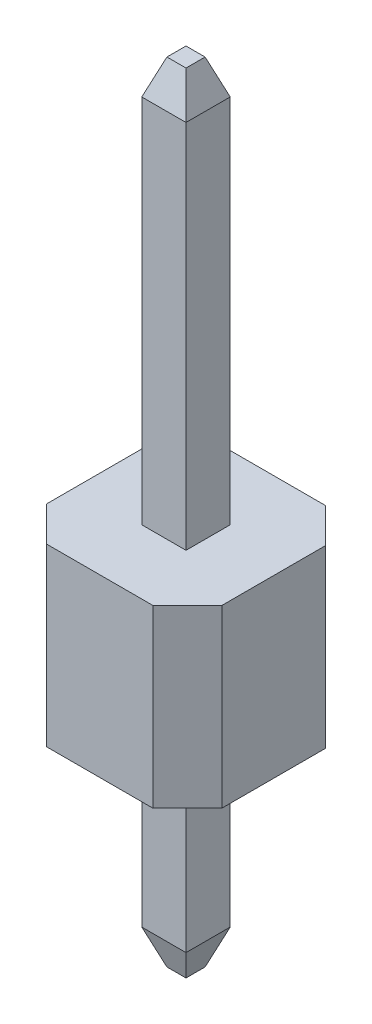
ISO-10303-21;
HEADER;
FILE_DESCRIPTION(('STEP AP214'),'2;1');
FILE_NAME('part.step','',(''),(''),'','','');
FILE_SCHEMA(('AUTOMOTIVE_DESIGN { 1 0 10303 214 1 1 1 1 }'));
ENDSEC;
DATA;
#1=APPLICATION_CONTEXT('core data for automotive mechanical design processes');
#2=APPLICATION_PROTOCOL_DEFINITION('international standard','automotive_design',2000,#1);
#3=PRODUCT_CONTEXT('',#1,'mechanical');
#4=PRODUCT('Part','Part','',(#3));
#5=PRODUCT_RELATED_PRODUCT_CATEGORY('part','',(#4));
#6=PRODUCT_DEFINITION_FORMATION('','',#4);
#7=PRODUCT_DEFINITION_CONTEXT('part definition',#1,'design');
#8=PRODUCT_DEFINITION('design','',#6,#7);
#9=PRODUCT_DEFINITION_SHAPE('','',#8);
#10=(LENGTH_UNIT() NAMED_UNIT(*) SI_UNIT(.MILLI.,.METRE.));
#11=(NAMED_UNIT(*) PLANE_ANGLE_UNIT() SI_UNIT($,.RADIAN.));
#12=(NAMED_UNIT(*) SI_UNIT($,.STERADIAN.) SOLID_ANGLE_UNIT());
#13=UNCERTAINTY_MEASURE_WITH_UNIT(LENGTH_MEASURE(1.E-05),#10,'distance_accuracy_value','');
#14=(GEOMETRIC_REPRESENTATION_CONTEXT(3) GLOBAL_UNCERTAINTY_ASSIGNED_CONTEXT((#13)) GLOBAL_UNIT_ASSIGNED_CONTEXT((#10,
#11,#12)) REPRESENTATION_CONTEXT('',''));
#15=CARTESIAN_POINT('',(0.,0.,0.));
#16=DIRECTION('',(0.,0.,1.));
#17=DIRECTION('',(1.,0.,0.));
#18=AXIS2_PLACEMENT_3D('',#15,#16,#17);
#19=CARTESIAN_POINT('',(-20.5046575219933,-116.166087876259,67.0858140827478));
#20=DIRECTION('',(0.,0.342020143325667,-0.939692620785909));
#21=DIRECTION('',(-1.,0.,0.));
#22=AXIS2_PLACEMENT_3D('',#19,#20,#21);
#23=PLANE('',#22);
#24=DIRECTION('',(0.323615577118189,0.889126490715985,0.323615577118189));
#25=VECTOR('',#24,1.);
#26=CARTESIAN_POINT('',(-20.381096529517,-116.205799613767,67.0713601923572));
#27=LINE('',#26,#25);
#28=CARTESIAN_POINT('',(-20.3666426391264,-116.166087876259,67.0858140827478));
#29=VERTEX_POINT('',#28);
#30=CARTESIAN_POINT('',(-20.1846575219933,-115.666087876259,67.2677991998809));
#31=VERTEX_POINT('',#30);
#32=EDGE_CURVE('E41',#29,#31,#27,.T.);
#33=ORIENTED_EDGE('',*,*,#32,.T.);
#34=DIRECTION('',(1.,0.,0.));
#35=VECTOR('',#34,1.);
#36=CARTESIAN_POINT('',(-20.1846575219833,-115.666087876269,67.2677991998909));
#37=LINE('',#36,#35);
#38=CARTESIAN_POINT('',(-20.8246575219933,-115.666087876259,67.2677991998809));
#39=VERTEX_POINT('',#38);
#40=EDGE_CURVE('E11',#39,#31,#37,.T.);
#41=ORIENTED_EDGE('',*,*,#40,.F.);
#42=DIRECTION('',(0.323615577118189,-0.889126490715985,-0.323615577118189));
#43=VECTOR('',#42,1.);
#44=CARTESIAN_POINT('',(-20.6282185144696,-116.205799613767,67.0713601923572));
#45=LINE('',#44,#43);
#46=CARTESIAN_POINT('',(-20.6426724048602,-116.166087876259,67.0858140827478));
#47=VERTEX_POINT('',#46);
#48=EDGE_CURVE('E241',#39,#47,#45,.T.);
#49=ORIENTED_EDGE('',*,*,#48,.T.);
#50=DIRECTION('',(-1.,0.,0.));
#51=VECTOR('',#50,1.);
#52=CARTESIAN_POINT('',(-20.5046575219933,-116.166087876269,67.0858140827578));
#53=LINE('',#52,#51);
#54=EDGE_CURVE('E246',#29,#47,#53,.T.);
#55=ORIENTED_EDGE('',*,*,#54,.F.);
#56=EDGE_LOOP('',(#33,#41,#49,#55));
#57=FACE_BOUND('',#56,.T.);
#58=ADVANCED_FACE('F17',(#57),#23,.F.);
#59=CARTESIAN_POINT('',(-20.1846575219933,-104.766087876259,67.2677991998809));
#60=DIRECTION('',(0.,0.,-1.));
#61=DIRECTION('',(0.,-1.,0.));
#62=AXIS2_PLACEMENT_3D('',#59,#60,#61);
#63=PLANE('',#62);
#64=DIRECTION('',(1.,0.,0.));
#65=VECTOR('',#64,1.);
#66=CARTESIAN_POINT('',(-20.1846575219833,-113.166087876259,67.2677991998909));
#67=LINE('',#66,#65);
#68=CARTESIAN_POINT('',(-20.8246575219933,-113.166087876259,67.2677991998809));
#69=VERTEX_POINT('',#68);
#70=CARTESIAN_POINT('',(-20.1846575219933,-113.166087876259,67.2677991998809));
#71=VERTEX_POINT('',#70);
#72=EDGE_CURVE('E271',#69,#71,#67,.T.);
#73=ORIENTED_EDGE('',*,*,#72,.F.);
#74=DIRECTION('',(0.,-1.,0.));
#75=VECTOR('',#74,1.);
#76=CARTESIAN_POINT('',(-20.8246575220033,-104.766087876249,67.2677991998909));
#77=LINE('',#76,#75);
#78=EDGE_CURVE('E198',#69,#39,#77,.T.);
#79=ORIENTED_EDGE('',*,*,#78,.T.);
#80=ORIENTED_EDGE('',*,*,#40,.T.);
#81=DIRECTION('',(0.,-1.,0.));
#82=VECTOR('',#81,1.);
#83=CARTESIAN_POINT('',(-20.1846575219833,-104.766087876249,67.2677991998909));
#84=LINE('',#83,#82);
#85=EDGE_CURVE('E289',#71,#31,#84,.T.);
#86=ORIENTED_EDGE('',*,*,#85,.F.);
#87=EDGE_LOOP('',(#73,#79,#80,#86));
#88=FACE_BOUND('',#87,.T.);
#89=ADVANCED_FACE('F459',(#88),#63,.F.);
#90=CARTESIAN_POINT('',(-20.1846575219933,-104.766087876259,67.2677991998809));
#91=DIRECTION('',(0.,0.,-1.));
#92=DIRECTION('',(0.,-1.,0.));
#93=AXIS2_PLACEMENT_3D('',#90,#91,#92);
#94=PLANE('',#93);
#95=DIRECTION('',(0.,-1.,0.));
#96=VECTOR('',#95,1.);
#97=CARTESIAN_POINT('',(-20.8246575220033,-104.766087876249,67.2677991998909));
#98=LINE('',#97,#96);
#99=CARTESIAN_POINT('',(-20.8246575219933,-105.266087876259,67.2677991998809));
#100=VERTEX_POINT('',#99);
#101=CARTESIAN_POINT('',(-20.8246575219933,-110.626087876259,67.2677991998809));
#102=VERTEX_POINT('',#101);
#103=EDGE_CURVE('E27',#100,#102,#98,.T.);
#104=ORIENTED_EDGE('',*,*,#103,.T.);
#105=DIRECTION('',(1.,0.,0.));
#106=VECTOR('',#105,1.);
#107=CARTESIAN_POINT('',(-20.1846575219833,-110.626087876249,67.2677991998909));
#108=LINE('',#107,#106);
#109=CARTESIAN_POINT('',(-20.1846575219933,-110.626087876259,67.2677991998809));
#110=VERTEX_POINT('',#109);
#111=EDGE_CURVE('E230',#102,#110,#108,.T.);
#112=ORIENTED_EDGE('',*,*,#111,.T.);
#113=DIRECTION('',(0.,-1.,0.));
#114=VECTOR('',#113,1.);
#115=CARTESIAN_POINT('',(-20.1846575219833,-104.766087876249,67.2677991998909));
#116=LINE('',#115,#114);
#117=CARTESIAN_POINT('',(-20.1846575219933,-105.266087876259,67.2677991998809));
#118=VERTEX_POINT('',#117);
#119=EDGE_CURVE('E302',#118,#110,#116,.T.);
#120=ORIENTED_EDGE('',*,*,#119,.F.);
#121=DIRECTION('',(-1.,0.,0.));
#122=VECTOR('',#121,1.);
#123=CARTESIAN_POINT('',(-20.8246575220033,-105.266087876249,67.2677991998909));
#124=LINE('',#123,#122);
#125=EDGE_CURVE('E247',#118,#100,#124,.T.);
#126=ORIENTED_EDGE('',*,*,#125,.T.);
#127=EDGE_LOOP('',(#104,#112,#120,#126));
#128=FACE_BOUND('',#127,.T.);
#129=ADVANCED_FACE('F465',(#128),#94,.F.);
#130=CARTESIAN_POINT('',(-20.5046575219933,-104.766087876259,66.9477991998809));
#131=DIRECTION('',(0.,1.,0.));
#132=DIRECTION('',(1.,0.,0.));
#133=AXIS2_PLACEMENT_3D('',#130,#131,#132);
#134=PLANE('',#133);
#135=DIRECTION('',(-1.,0.,0.));
#136=VECTOR('',#135,1.);
#137=CARTESIAN_POINT('',(-20.8246575220033,-104.766087876249,66.809784317004));
#138=LINE('',#137,#136);
#139=CARTESIAN_POINT('',(-20.3666426391264,-104.766087876259,66.809784317014));
#140=VERTEX_POINT('',#139);
#141=CARTESIAN_POINT('',(-20.6426724048602,-104.766087876259,66.809784317014));
#142=VERTEX_POINT('',#141);
#143=EDGE_CURVE('E240',#140,#142,#138,.T.);
#144=ORIENTED_EDGE('',*,*,#143,.T.);
#145=DIRECTION('',(0.,0.,1.));
#146=VECTOR('',#145,1.);
#147=CARTESIAN_POINT('',(-20.6426724048702,-104.766087876249,67.2677991998909));
#148=LINE('',#147,#146);
#149=CARTESIAN_POINT('',(-20.6426724048602,-104.766087876259,67.0858140827478));
#150=VERTEX_POINT('',#149);
#151=EDGE_CURVE('E305',#142,#150,#148,.T.);
#152=ORIENTED_EDGE('',*,*,#151,.T.);
#153=DIRECTION('',(1.,0.,0.));
#154=VECTOR('',#153,1.);
#155=CARTESIAN_POINT('',(-20.1846575219833,-104.766087876249,67.0858140827578));
#156=LINE('',#155,#154);
#157=CARTESIAN_POINT('',(-20.3666426391264,-104.766087876259,67.0858140827478));
#158=VERTEX_POINT('',#157);
#159=EDGE_CURVE('E254',#150,#158,#156,.T.);
#160=ORIENTED_EDGE('',*,*,#159,.T.);
#161=DIRECTION('',(0.,0.,-1.));
#162=VECTOR('',#161,1.);
#163=CARTESIAN_POINT('',(-20.3666426391164,-104.766087876249,66.6277991998709));
#164=LINE('',#163,#162);
#165=EDGE_CURVE('E270',#158,#140,#164,.T.);
#166=ORIENTED_EDGE('',*,*,#165,.T.);
#167=EDGE_LOOP('',(#144,#152,#160,#166));
#168=FACE_BOUND('',#167,.T.);
#169=ADVANCED_FACE('F473',(#168),#134,.T.);
#170=CARTESIAN_POINT('',(-20.8246575219933,-104.766087876259,67.2677991998809));
#171=DIRECTION('',(1.,0.,0.));
#172=DIRECTION('',(0.,0.,1.));
#173=AXIS2_PLACEMENT_3D('',#170,#171,#172);
#174=PLANE('',#173);
#175=DIRECTION('',(0.,-1.,0.));
#176=VECTOR('',#175,1.);
#177=CARTESIAN_POINT('',(-20.8246575220033,-104.766087876249,66.6277991998709));
#178=LINE('',#177,#176);
#179=CARTESIAN_POINT('',(-20.8246575219933,-105.266087876259,66.6277991998809));
#180=VERTEX_POINT('',#179);
#181=CARTESIAN_POINT('',(-20.8246575219933,-110.626087876259,66.6277991998809));
#182=VERTEX_POINT('',#181);
#183=EDGE_CURVE('E231',#180,#182,#178,.T.);
#184=ORIENTED_EDGE('',*,*,#183,.T.);
#185=DIRECTION('',(0.,0.,1.));
#186=VECTOR('',#185,1.);
#187=CARTESIAN_POINT('',(-20.8246575220033,-110.626087876249,67.2677991998909));
#188=LINE('',#187,#186);
#189=EDGE_CURVE('E226',#182,#102,#188,.T.);
#190=ORIENTED_EDGE('',*,*,#189,.T.);
#191=ORIENTED_EDGE('',*,*,#103,.F.);
#192=DIRECTION('',(0.,0.,-1.));
#193=VECTOR('',#192,1.);
#194=CARTESIAN_POINT('',(-20.8246575220033,-105.266087876249,66.6277991998709));
#195=LINE('',#194,#193);
#196=EDGE_CURVE('E393',#100,#180,#195,.T.);
#197=ORIENTED_EDGE('',*,*,#196,.T.);
#198=EDGE_LOOP('',(#184,#190,#191,#197));
#199=FACE_BOUND('',#198,.T.);
#200=ADVANCED_FACE('F470',(#199),#174,.F.);
#201=CARTESIAN_POINT('',(-20.3666426391264,-104.766087876259,66.9477991998809));
#202=DIRECTION('',(0.939692620785909,0.342020143325666,0.));
#203=DIRECTION('',(0.,0.,-1.));
#204=AXIS2_PLACEMENT_3D('',#201,#202,#203);
#205=PLANE('',#204);
#206=DIRECTION('',(-0.323615577118188,0.889126490715986,-0.323615577118188));
#207=VECTOR('',#206,1.);
#208=CARTESIAN_POINT('',(-20.381096529517,-104.72637613875,67.0713601923572));
#209=LINE('',#208,#207);
#210=EDGE_CURVE('E258',#118,#158,#209,.T.);
#211=ORIENTED_EDGE('',*,*,#210,.F.);
#212=DIRECTION('',(0.,0.,1.));
#213=VECTOR('',#212,1.);
#214=CARTESIAN_POINT('',(-20.1846575219833,-105.266087876249,67.2677991998909));
#215=LINE('',#214,#213);
#216=CARTESIAN_POINT('',(-20.1846575219933,-105.266087876259,66.6277991998809));
#217=VERTEX_POINT('',#216);
#218=EDGE_CURVE('E236',#217,#118,#215,.T.);
#219=ORIENTED_EDGE('',*,*,#218,.F.);
#220=DIRECTION('',(0.323615577118188,-0.889126490715986,-0.323615577118188));
#221=VECTOR('',#220,1.);
#222=CARTESIAN_POINT('',(-20.381096529517,-104.72637613875,66.8242382074046));
#223=LINE('',#222,#221);
#224=EDGE_CURVE('E237',#140,#217,#223,.T.);
#225=ORIENTED_EDGE('',*,*,#224,.F.);
#226=ORIENTED_EDGE('',*,*,#165,.F.);
#227=EDGE_LOOP('',(#211,#219,#225,#226));
#228=FACE_BOUND('',#227,.T.);
#229=ADVANCED_FACE('F454',(#228),#205,.T.);
#230=CARTESIAN_POINT('',(-20.5046575219933,-116.166087876259,66.809784317014));
#231=DIRECTION('',(0.,0.342020143325667,0.939692620785909));
#232=DIRECTION('',(1.,0.,0.));
#233=AXIS2_PLACEMENT_3D('',#230,#231,#232);
#234=PLANE('',#233);
#235=DIRECTION('',(0.323615577118189,-0.889126490715985,0.323615577118189));
#236=VECTOR('',#235,1.);
#237=CARTESIAN_POINT('',(-20.6282185144696,-116.205799613767,66.8242382074046));
#238=LINE('',#237,#236);
#239=CARTESIAN_POINT('',(-20.8246575219933,-115.666087876259,66.6277991998809));
#240=VERTEX_POINT('',#239);
#241=CARTESIAN_POINT('',(-20.6426724048602,-116.166087876259,66.809784317014));
#242=VERTEX_POINT('',#241);
#243=EDGE_CURVE('E328',#240,#242,#238,.T.);
#244=ORIENTED_EDGE('',*,*,#243,.F.);
#245=DIRECTION('',(-1.,0.,0.));
#246=VECTOR('',#245,1.);
#247=CARTESIAN_POINT('',(-20.1846575219833,-115.666087876269,66.6277991998709));
#248=LINE('',#247,#246);
#249=CARTESIAN_POINT('',(-20.1846575219933,-115.666087876259,66.6277991998809));
#250=VERTEX_POINT('',#249);
#251=EDGE_CURVE('E262',#250,#240,#248,.T.);
#252=ORIENTED_EDGE('',*,*,#251,.F.);
#253=DIRECTION('',(0.323615577118189,0.889126490715985,-0.323615577118189));
#254=VECTOR('',#253,1.);
#255=CARTESIAN_POINT('',(-20.381096529517,-116.205799613767,66.8242382074046));
#256=LINE('',#255,#254);
#257=CARTESIAN_POINT('',(-20.3666426391264,-116.166087876259,66.809784317014));
#258=VERTEX_POINT('',#257);
#259=EDGE_CURVE('E55',#258,#250,#256,.T.);
#260=ORIENTED_EDGE('',*,*,#259,.F.);
#261=DIRECTION('',(1.,0.,0.));
#262=VECTOR('',#261,1.);
#263=CARTESIAN_POINT('',(-20.5046575219933,-116.166087876269,66.809784317004));
#264=LINE('',#263,#262);
#265=EDGE_CURVE('E301',#242,#258,#264,.T.);
#266=ORIENTED_EDGE('',*,*,#265,.F.);
#267=EDGE_LOOP('',(#244,#252,#260,#266));
#268=FACE_BOUND('',#267,.T.);
#269=ADVANCED_FACE('F445',(#268),#234,.F.);
#270=CARTESIAN_POINT('',(-20.3666426391264,-116.166087876259,66.9477991998809));
#271=DIRECTION('',(-0.939692620785909,0.342020143325667,0.));
#272=DIRECTION('',(0.,0.,1.));
#273=AXIS2_PLACEMENT_3D('',#270,#271,#272);
#274=PLANE('',#273);
#275=ORIENTED_EDGE('',*,*,#259,.T.);
#276=DIRECTION('',(0.,0.,-1.));
#277=VECTOR('',#276,1.);
#278=CARTESIAN_POINT('',(-20.1846575219833,-115.666087876269,67.2677991998909));
#279=LINE('',#278,#277);
#280=EDGE_CURVE('E253',#31,#250,#279,.T.);
#281=ORIENTED_EDGE('',*,*,#280,.F.);
#282=ORIENTED_EDGE('',*,*,#32,.F.);
#283=DIRECTION('',(0.,0.,1.));
#284=VECTOR('',#283,1.);
#285=CARTESIAN_POINT('',(-20.3666426391164,-116.166087876269,66.9477991998909));
#286=LINE('',#285,#284);
#287=EDGE_CURVE('E242',#258,#29,#286,.T.);
#288=ORIENTED_EDGE('',*,*,#287,.F.);
#289=EDGE_LOOP('',(#275,#281,#282,#288));
#290=FACE_BOUND('',#289,.T.);
#291=ADVANCED_FACE('F443',(#290),#274,.F.);
#292=CARTESIAN_POINT('',(-20.5046575219933,-116.166087876259,66.9477991998809));
#293=DIRECTION('',(0.,1.,0.));
#294=DIRECTION('',(1.,0.,0.));
#295=AXIS2_PLACEMENT_3D('',#292,#293,#294);
#296=PLANE('',#295);
#297=ORIENTED_EDGE('',*,*,#287,.T.);
#298=ORIENTED_EDGE('',*,*,#54,.T.);
#299=DIRECTION('',(0.,0.,-1.));
#300=VECTOR('',#299,1.);
#301=CARTESIAN_POINT('',(-20.6426724048702,-116.166087876269,66.9477991998809));
#302=LINE('',#301,#300);
#303=EDGE_CURVE('E324',#47,#242,#302,.T.);
#304=ORIENTED_EDGE('',*,*,#303,.T.);
#305=ORIENTED_EDGE('',*,*,#265,.T.);
#306=EDGE_LOOP('',(#297,#298,#304,#305));
#307=FACE_BOUND('',#306,.T.);
#308=ADVANCED_FACE('F441',(#307),#296,.F.);
#309=CARTESIAN_POINT('',(-19.2346575219933,-110.626087876259,68.1977991998809));
#310=DIRECTION('',(0.,0.,-1.));
#311=DIRECTION('',(-1.,0.,0.));
#312=AXIS2_PLACEMENT_3D('',#309,#310,#311);
#313=PLANE('',#312);
#314=DIRECTION('',(1.,0.,0.));
#315=VECTOR('',#314,1.);
#316=CARTESIAN_POINT('',(-19.2346575219833,-110.626087876249,68.1977991998909));
#317=LINE('',#316,#315);
#318=CARTESIAN_POINT('',(-21.2746575219933,-110.626087876259,68.1977991998809));
#319=VERTEX_POINT('',#318);
#320=CARTESIAN_POINT('',(-19.7346575219933,-110.626087876259,68.1977991998809));
#321=VERTEX_POINT('',#320);
#322=EDGE_CURVE('E283',#319,#321,#317,.T.);
#323=ORIENTED_EDGE('',*,*,#322,.F.);
#324=DIRECTION('',(0.,-1.,0.));
#325=VECTOR('',#324,1.);
#326=CARTESIAN_POINT('',(-21.2746575220033,-110.626087876249,68.1977991998909));
#327=LINE('',#326,#325);
#328=CARTESIAN_POINT('',(-21.2746575219933,-113.166087876259,68.1977991998809));
#329=VERTEX_POINT('',#328);
#330=EDGE_CURVE('E259',#319,#329,#327,.T.);
#331=ORIENTED_EDGE('',*,*,#330,.T.);
#332=DIRECTION('',(1.,0.,0.));
#333=VECTOR('',#332,1.);
#334=CARTESIAN_POINT('',(-19.2346575219833,-113.166087876259,68.1977991998909));
#335=LINE('',#334,#333);
#336=CARTESIAN_POINT('',(-19.7346575219933,-113.166087876259,68.1977991998809));
#337=VERTEX_POINT('',#336);
#338=EDGE_CURVE('E329',#329,#337,#335,.T.);
#339=ORIENTED_EDGE('',*,*,#338,.T.);
#340=DIRECTION('',(0.,1.,0.));
#341=VECTOR('',#340,1.);
#342=CARTESIAN_POINT('',(-19.7346575219833,-110.626087876249,68.1977991998909));
#343=LINE('',#342,#341);
#344=EDGE_CURVE('E320',#337,#321,#343,.T.);
#345=ORIENTED_EDGE('',*,*,#344,.T.);
#346=EDGE_LOOP('',(#323,#331,#339,#345));
#347=FACE_BOUND('',#346,.T.);
#348=ADVANCED_FACE('F452',(#347),#313,.F.);
#349=CARTESIAN_POINT('',(-21.7746575219933,-110.626087876259,68.1977991998809));
#350=DIRECTION('',(1.,0.,0.));
#351=DIRECTION('',(0.,0.,1.));
#352=AXIS2_PLACEMENT_3D('',#349,#350,#351);
#353=PLANE('',#352);
#354=DIRECTION('',(0.,0.,1.));
#355=VECTOR('',#354,1.);
#356=CARTESIAN_POINT('',(-21.7746575220033,-113.166087876259,68.1977991998909));
#357=LINE('',#356,#355);
#358=CARTESIAN_POINT('',(-21.7746575219933,-113.166087876259,66.1977991998809));
#359=VERTEX_POINT('',#358);
#360=CARTESIAN_POINT('',(-21.7746575219933,-113.166087876259,67.6977991998809));
#361=VERTEX_POINT('',#360);
#362=EDGE_CURVE('E334',#359,#361,#357,.T.);
#363=ORIENTED_EDGE('',*,*,#362,.T.);
#364=DIRECTION('',(0.,1.,0.));
#365=VECTOR('',#364,1.);
#366=CARTESIAN_POINT('',(-21.7746575220033,-110.626087876249,67.6977991998909));
#367=LINE('',#366,#365);
#368=CARTESIAN_POINT('',(-21.7746575219933,-110.626087876259,67.6977991998809));
#369=VERTEX_POINT('',#368);
#370=EDGE_CURVE('E252',#361,#369,#367,.T.);
#371=ORIENTED_EDGE('',*,*,#370,.T.);
#372=DIRECTION('',(0.,0.,1.));
#373=VECTOR('',#372,1.);
#374=CARTESIAN_POINT('',(-21.7746575220033,-110.626087876249,68.1977991998909));
#375=LINE('',#374,#373);
#376=CARTESIAN_POINT('',(-21.7746575219933,-110.626087876259,66.1977991998809));
#377=VERTEX_POINT('',#376);
#378=EDGE_CURVE('E276',#377,#369,#375,.T.);
#379=ORIENTED_EDGE('',*,*,#378,.F.);
#380=DIRECTION('',(0.,-1.,0.));
#381=VECTOR('',#380,1.);
#382=CARTESIAN_POINT('',(-21.7746575220033,-110.626087876249,66.1977991998709));
#383=LINE('',#382,#381);
#384=EDGE_CURVE('E197',#377,#359,#383,.T.);
#385=ORIENTED_EDGE('',*,*,#384,.T.);
#386=EDGE_LOOP('',(#363,#371,#379,#385));
#387=FACE_BOUND('',#386,.T.);
#388=ADVANCED_FACE('F370',(#387),#353,.F.);
#389=CARTESIAN_POINT('',(-19.2346575219933,-110.626087876259,65.6977991998809));
#390=DIRECTION('',(0.,0.,1.));
#391=DIRECTION('',(1.,0.,0.));
#392=AXIS2_PLACEMENT_3D('',#389,#390,#391);
#393=PLANE('',#392);
#394=DIRECTION('',(-1.,0.,0.));
#395=VECTOR('',#394,1.);
#396=CARTESIAN_POINT('',(-19.2346575219833,-113.166087876259,65.6977991998709));
#397=LINE('',#396,#395);
#398=CARTESIAN_POINT('',(-19.7346575219933,-113.166087876259,65.6977991998809));
#399=VERTEX_POINT('',#398);
#400=CARTESIAN_POINT('',(-21.2746575219933,-113.166087876259,65.6977991998809));
#401=VERTEX_POINT('',#400);
#402=EDGE_CURVE('E192',#399,#401,#397,.T.);
#403=ORIENTED_EDGE('',*,*,#402,.T.);
#404=DIRECTION('',(0.,1.,0.));
#405=VECTOR('',#404,1.);
#406=CARTESIAN_POINT('',(-21.2746575220033,-110.626087876249,65.6977991998709));
#407=LINE('',#406,#405);
#408=CARTESIAN_POINT('',(-21.2746575219933,-110.626087876259,65.6977991998809));
#409=VERTEX_POINT('',#408);
#410=EDGE_CURVE('E186',#401,#409,#407,.T.);
#411=ORIENTED_EDGE('',*,*,#410,.T.);
#412=DIRECTION('',(-1.,0.,0.));
#413=VECTOR('',#412,1.);
#414=CARTESIAN_POINT('',(-19.2346575219833,-110.626087876249,65.6977991998709));
#415=LINE('',#414,#413);
#416=CARTESIAN_POINT('',(-19.7346575219933,-110.626087876259,65.6977991998809));
#417=VERTEX_POINT('',#416);
#418=EDGE_CURVE('E189',#417,#409,#415,.T.);
#419=ORIENTED_EDGE('',*,*,#418,.F.);
#420=DIRECTION('',(0.,-1.,0.));
#421=VECTOR('',#420,1.);
#422=CARTESIAN_POINT('',(-19.7346575219833,-110.626087876249,65.6977991998709));
#423=LINE('',#422,#421);
#424=EDGE_CURVE('E345',#417,#399,#423,.T.);
#425=ORIENTED_EDGE('',*,*,#424,.T.);
#426=EDGE_LOOP('',(#403,#411,#419,#425));
#427=FACE_BOUND('',#426,.T.);
#428=ADVANCED_FACE('F19',(#427),#393,.F.);
#429=CARTESIAN_POINT('',(-19.2346575219933,-110.626087876259,68.1977991998809));
#430=DIRECTION('',(-1.,0.,0.));
#431=DIRECTION('',(0.,0.,1.));
#432=AXIS2_PLACEMENT_3D('',#429,#430,#431);
#433=PLANE('',#432);
#434=DIRECTION('',(0.,0.,-1.));
#435=VECTOR('',#434,1.);
#436=CARTESIAN_POINT('',(-19.2346575219833,-110.626087876249,68.1977991998909));
#437=LINE('',#436,#435);
#438=CARTESIAN_POINT('',(-19.2346575219933,-110.626087876259,67.6977991998809));
#439=VERTEX_POINT('',#438);
#440=CARTESIAN_POINT('',(-19.2346575219933,-110.626087876259,66.1977991998809));
#441=VERTEX_POINT('',#440);
#442=EDGE_CURVE('E220',#439,#441,#437,.T.);
#443=ORIENTED_EDGE('',*,*,#442,.F.);
#444=DIRECTION('',(0.,-1.,0.));
#445=VECTOR('',#444,1.);
#446=CARTESIAN_POINT('',(-19.2346575219833,-110.626087876249,67.6977991998909));
#447=LINE('',#446,#445);
#448=CARTESIAN_POINT('',(-19.2346575219933,-113.166087876259,67.6977991998809));
#449=VERTEX_POINT('',#448);
#450=EDGE_CURVE('E323',#439,#449,#447,.T.);
#451=ORIENTED_EDGE('',*,*,#450,.T.);
#452=DIRECTION('',(0.,0.,-1.));
#453=VECTOR('',#452,1.);
#454=CARTESIAN_POINT('',(-19.2346575219833,-113.166087876259,68.1977991998909));
#455=LINE('',#454,#453);
#456=CARTESIAN_POINT('',(-19.2346575219933,-113.166087876259,66.1977991998809));
#457=VERTEX_POINT('',#456);
#458=EDGE_CURVE('E388',#449,#457,#455,.T.);
#459=ORIENTED_EDGE('',*,*,#458,.T.);
#460=DIRECTION('',(0.,1.,0.));
#461=VECTOR('',#460,1.);
#462=CARTESIAN_POINT('',(-19.2346575219833,-110.626087876249,66.1977991998709));
#463=LINE('',#462,#461);
#464=EDGE_CURVE('E348',#457,#441,#463,.T.);
#465=ORIENTED_EDGE('',*,*,#464,.T.);
#466=EDGE_LOOP('',(#443,#451,#459,#465));
#467=FACE_BOUND('',#466,.T.);
#468=ADVANCED_FACE('F528',(#467),#433,.F.);
#469=CARTESIAN_POINT('',(-20.5046575219933,-104.766087876259,67.0858140827478));
#470=DIRECTION('',(0.,0.342020143325666,0.939692620785909));
#471=DIRECTION('',(1.,0.,0.));
#472=AXIS2_PLACEMENT_3D('',#469,#470,#471);
#473=PLANE('',#472);
#474=ORIENTED_EDGE('',*,*,#210,.T.);
#475=ORIENTED_EDGE('',*,*,#159,.F.);
#476=DIRECTION('',(0.323615577118188,0.889126490715986,-0.323615577118188));
#477=VECTOR('',#476,1.);
#478=CARTESIAN_POINT('',(-20.6282185144696,-104.72637613875,67.0713601923572));
#479=LINE('',#478,#477);
#480=EDGE_CURVE('E315',#100,#150,#479,.T.);
#481=ORIENTED_EDGE('',*,*,#480,.F.);
#482=ORIENTED_EDGE('',*,*,#125,.F.);
#483=EDGE_LOOP('',(#474,#475,#481,#482));
#484=FACE_BOUND('',#483,.T.);
#485=ADVANCED_FACE('F809',(#484),#473,.T.);
#486=CARTESIAN_POINT('',(-20.5046575219933,-104.766087876259,66.809784317014));
#487=DIRECTION('',(0.,0.342020143325666,-0.939692620785909));
#488=DIRECTION('',(-1.,0.,0.));
#489=AXIS2_PLACEMENT_3D('',#486,#487,#488);
#490=PLANE('',#489);
#491=ORIENTED_EDGE('',*,*,#224,.T.);
#492=DIRECTION('',(1.,0.,0.));
#493=VECTOR('',#492,1.);
#494=CARTESIAN_POINT('',(-20.1846575219833,-105.266087876249,66.6277991998709));
#495=LINE('',#494,#493);
#496=EDGE_CURVE('E235',#180,#217,#495,.T.);
#497=ORIENTED_EDGE('',*,*,#496,.F.);
#498=DIRECTION('',(-0.323615577118188,-0.889126490715986,-0.323615577118188));
#499=VECTOR('',#498,1.);
#500=CARTESIAN_POINT('',(-20.6282185144696,-104.72637613875,66.8242382074046));
#501=LINE('',#500,#499);
#502=EDGE_CURVE('E311',#142,#180,#501,.T.);
#503=ORIENTED_EDGE('',*,*,#502,.F.);
#504=ORIENTED_EDGE('',*,*,#143,.F.);
#505=EDGE_LOOP('',(#491,#497,#503,#504));
#506=FACE_BOUND('',#505,.T.);
#507=ADVANCED_FACE('F479',(#506),#490,.T.);
#508=CARTESIAN_POINT('',(-20.6426724048602,-116.166087876259,66.9477991998809));
#509=DIRECTION('',(0.939692620785909,0.342020143325667,0.));
#510=DIRECTION('',(0.,0.,-1.));
#511=AXIS2_PLACEMENT_3D('',#508,#509,#510);
#512=PLANE('',#511);
#513=ORIENTED_EDGE('',*,*,#243,.T.);
#514=ORIENTED_EDGE('',*,*,#303,.F.);
#515=ORIENTED_EDGE('',*,*,#48,.F.);
#516=DIRECTION('',(0.,0.,1.));
#517=VECTOR('',#516,1.);
#518=CARTESIAN_POINT('',(-20.8246575220033,-115.666087876269,67.2677991998909));
#519=LINE('',#518,#517);
#520=EDGE_CURVE('E319',#240,#39,#519,.T.);
#521=ORIENTED_EDGE('',*,*,#520,.F.);
#522=EDGE_LOOP('',(#513,#514,#515,#521));
#523=FACE_BOUND('',#522,.T.);
#524=ADVANCED_FACE('F475',(#523),#512,.F.);
#525=CARTESIAN_POINT('',(-19.7346575219933,-110.626087876259,65.6977991998809));
#526=DIRECTION('',(-0.707106781186549,0.,0.707106781186546));
#527=DIRECTION('',(0.,1.,0.));
#528=AXIS2_PLACEMENT_3D('',#525,#526,#527);
#529=PLANE('',#528);
#530=DIRECTION('',(-0.707106781186546,0.,-0.707106781186549));
#531=VECTOR('',#530,1.);
#532=CARTESIAN_POINT('',(-19.4946575219833,-110.626087876249,65.9377991998709));
#533=LINE('',#532,#531);
#534=EDGE_CURVE('E212',#441,#417,#533,.T.);
#535=ORIENTED_EDGE('',*,*,#534,.F.);
#536=ORIENTED_EDGE('',*,*,#464,.F.);
#537=DIRECTION('',(0.707106781186546,0.,0.707106781186549));
#538=VECTOR('',#537,1.);
#539=CARTESIAN_POINT('',(-19.7346575219833,-113.166087876259,65.6977991998709));
#540=LINE('',#539,#538);
#541=EDGE_CURVE('E379',#399,#457,#540,.T.);
#542=ORIENTED_EDGE('',*,*,#541,.F.);
#543=ORIENTED_EDGE('',*,*,#424,.F.);
#544=EDGE_LOOP('',(#535,#536,#542,#543));
#545=FACE_BOUND('',#544,.T.);
#546=ADVANCED_FACE('F478',(#545),#529,.F.);
#547=CARTESIAN_POINT('',(-19.2346575219933,-110.626087876259,67.6977991998809));
#548=DIRECTION('',(-0.707106781186545,0.,-0.70710678118655));
#549=DIRECTION('',(-0.70710678118655,0.,0.707106781186545));
#550=AXIS2_PLACEMENT_3D('',#547,#548,#549);
#551=PLANE('',#550);
#552=DIRECTION('',(0.70710678118655,0.,-0.707106781186545));
#553=VECTOR('',#552,1.);
#554=CARTESIAN_POINT('',(-19.4946575219833,-110.626087876249,67.9577991998909));
#555=LINE('',#554,#553);
#556=EDGE_CURVE('E352',#321,#439,#555,.T.);
#557=ORIENTED_EDGE('',*,*,#556,.F.);
#558=ORIENTED_EDGE('',*,*,#344,.F.);
#559=DIRECTION('',(-0.70710678118655,0.,0.707106781186545));
#560=VECTOR('',#559,1.);
#561=CARTESIAN_POINT('',(-19.2346575219833,-113.166087876259,67.6977991998909));
#562=LINE('',#561,#560);
#563=EDGE_CURVE('E275',#449,#337,#562,.T.);
#564=ORIENTED_EDGE('',*,*,#563,.F.);
#565=ORIENTED_EDGE('',*,*,#450,.F.);
#566=EDGE_LOOP('',(#557,#558,#564,#565));
#567=FACE_BOUND('',#566,.T.);
#568=ADVANCED_FACE('F524',(#567),#551,.F.);
#569=CARTESIAN_POINT('',(-21.7746575219933,-110.626087876259,66.1977991998809));
#570=DIRECTION('',(0.707106781186546,0.,0.707106781186549));
#571=DIRECTION('',(0.,-1.,0.));
#572=AXIS2_PLACEMENT_3D('',#569,#570,#571);
#573=PLANE('',#572);
#574=DIRECTION('',(-0.707106781186549,0.,0.707106781186546));
#575=VECTOR('',#574,1.);
#576=CARTESIAN_POINT('',(-21.5146575220033,-110.626087876249,65.9377991998709));
#577=LINE('',#576,#575);
#578=EDGE_CURVE('E201',#409,#377,#577,.T.);
#579=ORIENTED_EDGE('',*,*,#578,.F.);
#580=ORIENTED_EDGE('',*,*,#410,.F.);
#581=DIRECTION('',(0.707106781186549,0.,-0.707106781186546));
#582=VECTOR('',#581,1.);
#583=CARTESIAN_POINT('',(-21.7746575220033,-113.166087876259,66.1977991998709));
#584=LINE('',#583,#582);
#585=EDGE_CURVE('E337',#359,#401,#584,.T.);
#586=ORIENTED_EDGE('',*,*,#585,.F.);
#587=ORIENTED_EDGE('',*,*,#384,.F.);
#588=EDGE_LOOP('',(#579,#580,#586,#587));
#589=FACE_BOUND('',#588,.T.);
#590=ADVANCED_FACE('F202',(#589),#573,.F.);
#591=CARTESIAN_POINT('',(-20.8246575219933,-104.766087876259,67.2677991998809));
#592=DIRECTION('',(1.,0.,0.));
#593=DIRECTION('',(0.,0.,1.));
#594=AXIS2_PLACEMENT_3D('',#591,#592,#593);
#595=PLANE('',#594);
#596=DIRECTION('',(0.,0.,1.));
#597=VECTOR('',#596,1.);
#598=CARTESIAN_POINT('',(-20.8246575220033,-113.166087876259,67.2677991998909));
#599=LINE('',#598,#597);
#600=CARTESIAN_POINT('',(-20.8246575219933,-113.166087876259,66.6277991998809));
#601=VERTEX_POINT('',#600);
#602=EDGE_CURVE('E288',#601,#69,#599,.T.);
#603=ORIENTED_EDGE('',*,*,#602,.F.);
#604=DIRECTION('',(0.,-1.,0.));
#605=VECTOR('',#604,1.);
#606=CARTESIAN_POINT('',(-20.8246575220033,-104.766087876249,66.6277991998709));
#607=LINE('',#606,#605);
#608=EDGE_CURVE('E397',#601,#240,#607,.T.);
#609=ORIENTED_EDGE('',*,*,#608,.T.);
#610=ORIENTED_EDGE('',*,*,#520,.T.);
#611=ORIENTED_EDGE('',*,*,#78,.F.);
#612=EDGE_LOOP('',(#603,#609,#610,#611));
#613=FACE_BOUND('',#612,.T.);
#614=ADVANCED_FACE('F694',(#613),#595,.F.);
#615=CARTESIAN_POINT('',(-20.1846575219933,-104.766087876259,66.6277991998809));
#616=DIRECTION('',(0.,0.,1.));
#617=DIRECTION('',(1.,0.,0.));
#618=AXIS2_PLACEMENT_3D('',#615,#616,#617);
#619=PLANE('',#618);
#620=DIRECTION('',(-1.,0.,0.));
#621=VECTOR('',#620,1.);
#622=CARTESIAN_POINT('',(-20.1846575219833,-113.166087876259,66.6277991998709));
#623=LINE('',#622,#621);
#624=CARTESIAN_POINT('',(-20.1846575219933,-113.166087876259,66.6277991998809));
#625=VERTEX_POINT('',#624);
#626=EDGE_CURVE('E284',#625,#601,#623,.T.);
#627=ORIENTED_EDGE('',*,*,#626,.F.);
#628=DIRECTION('',(0.,-1.,0.));
#629=VECTOR('',#628,1.);
#630=CARTESIAN_POINT('',(-20.1846575219833,-104.766087876249,66.6277991998709));
#631=LINE('',#630,#629);
#632=EDGE_CURVE('E248',#625,#250,#631,.T.);
#633=ORIENTED_EDGE('',*,*,#632,.T.);
#634=ORIENTED_EDGE('',*,*,#251,.T.);
#635=ORIENTED_EDGE('',*,*,#608,.F.);
#636=EDGE_LOOP('',(#627,#633,#634,#635));
#637=FACE_BOUND('',#636,.T.);
#638=ADVANCED_FACE('F691',(#637),#619,.F.);
#639=CARTESIAN_POINT('',(-21.2746575219933,-110.626087876259,68.1977991998809));
#640=DIRECTION('',(0.707106781186548,0.,-0.707106781186548));
#641=DIRECTION('',(0.,-1.,0.));
#642=AXIS2_PLACEMENT_3D('',#639,#640,#641);
#643=PLANE('',#642);
#644=DIRECTION('',(0.707106781186548,0.,0.707106781186548));
#645=VECTOR('',#644,1.);
#646=CARTESIAN_POINT('',(-21.5146575220033,-110.626087876249,67.9577991998909));
#647=LINE('',#646,#645);
#648=EDGE_CURVE('E279',#369,#319,#647,.T.);
#649=ORIENTED_EDGE('',*,*,#648,.F.);
#650=ORIENTED_EDGE('',*,*,#370,.F.);
#651=DIRECTION('',(-0.707106781186548,0.,-0.707106781186548));
#652=VECTOR('',#651,1.);
#653=CARTESIAN_POINT('',(-21.2746575220033,-113.166087876259,68.1977991998909));
#654=LINE('',#653,#652);
#655=EDGE_CURVE('E333',#329,#361,#654,.T.);
#656=ORIENTED_EDGE('',*,*,#655,.F.);
#657=ORIENTED_EDGE('',*,*,#330,.F.);
#658=EDGE_LOOP('',(#649,#650,#656,#657));
#659=FACE_BOUND('',#658,.T.);
#660=ADVANCED_FACE('F367',(#659),#643,.F.);
#661=CARTESIAN_POINT('',(-20.1846575219933,-104.766087876259,67.2677991998809));
#662=DIRECTION('',(-1.,0.,0.));
#663=DIRECTION('',(0.,0.,1.));
#664=AXIS2_PLACEMENT_3D('',#661,#662,#663);
#665=PLANE('',#664);
#666=DIRECTION('',(0.,0.,-1.));
#667=VECTOR('',#666,1.);
#668=CARTESIAN_POINT('',(-20.1846575219833,-113.166087876259,67.2677991998909));
#669=LINE('',#668,#667);
#670=EDGE_CURVE('E224',#71,#625,#669,.T.);
#671=ORIENTED_EDGE('',*,*,#670,.F.);
#672=ORIENTED_EDGE('',*,*,#85,.T.);
#673=ORIENTED_EDGE('',*,*,#280,.T.);
#674=ORIENTED_EDGE('',*,*,#632,.F.);
#675=EDGE_LOOP('',(#671,#672,#673,#674));
#676=FACE_BOUND('',#675,.T.);
#677=ADVANCED_FACE('F543',(#676),#665,.F.);
#678=CARTESIAN_POINT('',(-20.1846575219933,-104.766087876259,66.6277991998809));
#679=DIRECTION('',(0.,0.,1.));
#680=DIRECTION('',(1.,0.,0.));
#681=AXIS2_PLACEMENT_3D('',#678,#679,#680);
#682=PLANE('',#681);
#683=DIRECTION('',(0.,-1.,0.));
#684=VECTOR('',#683,1.);
#685=CARTESIAN_POINT('',(-20.1846575219833,-104.766087876249,66.6277991998709));
#686=LINE('',#685,#684);
#687=CARTESIAN_POINT('',(-20.1846575219933,-110.626087876259,66.6277991998809));
#688=VERTEX_POINT('',#687);
#689=EDGE_CURVE('E21',#217,#688,#686,.T.);
#690=ORIENTED_EDGE('',*,*,#689,.T.);
#691=DIRECTION('',(-1.,0.,0.));
#692=VECTOR('',#691,1.);
#693=CARTESIAN_POINT('',(-20.1846575219833,-110.626087876249,66.6277991998709));
#694=LINE('',#693,#692);
#695=EDGE_CURVE('E229',#688,#182,#694,.T.);
#696=ORIENTED_EDGE('',*,*,#695,.T.);
#697=ORIENTED_EDGE('',*,*,#183,.F.);
#698=ORIENTED_EDGE('',*,*,#496,.T.);
#699=EDGE_LOOP('',(#690,#696,#697,#698));
#700=FACE_BOUND('',#699,.T.);
#701=ADVANCED_FACE('F486',(#700),#682,.F.);
#702=CARTESIAN_POINT('',(-20.1846575219933,-104.766087876259,67.2677991998809));
#703=DIRECTION('',(-1.,0.,0.));
#704=DIRECTION('',(0.,0.,1.));
#705=AXIS2_PLACEMENT_3D('',#702,#703,#704);
#706=PLANE('',#705);
#707=ORIENTED_EDGE('',*,*,#119,.T.);
#708=DIRECTION('',(0.,0.,-1.));
#709=VECTOR('',#708,1.);
#710=CARTESIAN_POINT('',(-20.1846575219833,-110.626087876249,67.2677991998909));
#711=LINE('',#710,#709);
#712=EDGE_CURVE('E207',#110,#688,#711,.T.);
#713=ORIENTED_EDGE('',*,*,#712,.T.);
#714=ORIENTED_EDGE('',*,*,#689,.F.);
#715=ORIENTED_EDGE('',*,*,#218,.T.);
#716=EDGE_LOOP('',(#707,#713,#714,#715));
#717=FACE_BOUND('',#716,.T.);
#718=ADVANCED_FACE('F483',(#717),#706,.F.);
#719=CARTESIAN_POINT('',(-20.6426724048602,-104.766087876259,66.9477991998809));
#720=DIRECTION('',(-0.939692620785909,0.342020143325666,0.));
#721=DIRECTION('',(0.,0.,1.));
#722=AXIS2_PLACEMENT_3D('',#719,#720,#721);
#723=PLANE('',#722);
#724=ORIENTED_EDGE('',*,*,#502,.T.);
#725=ORIENTED_EDGE('',*,*,#196,.F.);
#726=ORIENTED_EDGE('',*,*,#480,.T.);
#727=ORIENTED_EDGE('',*,*,#151,.F.);
#728=EDGE_LOOP('',(#724,#725,#726,#727));
#729=FACE_BOUND('',#728,.T.);
#730=ADVANCED_FACE('F485',(#729),#723,.T.);
#731=CARTESIAN_POINT('',(-20.5046575219933,-113.166087876259,66.9477991998809));
#732=DIRECTION('',(0.,1.,0.));
#733=DIRECTION('',(1.,0.,0.));
#734=AXIS2_PLACEMENT_3D('',#731,#732,#733);
#735=PLANE('',#734);
#736=ORIENTED_EDGE('',*,*,#72,.T.);
#737=ORIENTED_EDGE('',*,*,#670,.T.);
#738=ORIENTED_EDGE('',*,*,#626,.T.);
#739=ORIENTED_EDGE('',*,*,#602,.T.);
#740=EDGE_LOOP('',(#736,#737,#738,#739));
#741=FACE_BOUND('',#740,.T.);
#742=ORIENTED_EDGE('',*,*,#338,.F.);
#743=ORIENTED_EDGE('',*,*,#655,.T.);
#744=ORIENTED_EDGE('',*,*,#362,.F.);
#745=ORIENTED_EDGE('',*,*,#585,.T.);
#746=ORIENTED_EDGE('',*,*,#402,.F.);
#747=ORIENTED_EDGE('',*,*,#541,.T.);
#748=ORIENTED_EDGE('',*,*,#458,.F.);
#749=ORIENTED_EDGE('',*,*,#563,.T.);
#750=EDGE_LOOP('',(#742,#743,#744,#745,#746,#747,#748,#749));
#751=FACE_BOUND('',#750,.T.);
#752=ADVANCED_FACE('F363',(#741,#751),#735,.F.);
#753=CARTESIAN_POINT('',(-20.5046575219933,-110.626087876259,66.9477991998809));
#754=DIRECTION('',(0.,1.,0.));
#755=DIRECTION('',(1.,0.,0.));
#756=AXIS2_PLACEMENT_3D('',#753,#754,#755);
#757=PLANE('',#756);
#758=ORIENTED_EDGE('',*,*,#712,.F.);
#759=ORIENTED_EDGE('',*,*,#111,.F.);
#760=ORIENTED_EDGE('',*,*,#189,.F.);
#761=ORIENTED_EDGE('',*,*,#695,.F.);
#762=EDGE_LOOP('',(#758,#759,#760,#761));
#763=FACE_BOUND('',#762,.T.);
#764=ORIENTED_EDGE('',*,*,#378,.T.);
#765=ORIENTED_EDGE('',*,*,#648,.T.);
#766=ORIENTED_EDGE('',*,*,#322,.T.);
#767=ORIENTED_EDGE('',*,*,#556,.T.);
#768=ORIENTED_EDGE('',*,*,#442,.T.);
#769=ORIENTED_EDGE('',*,*,#534,.T.);
#770=ORIENTED_EDGE('',*,*,#418,.T.);
#771=ORIENTED_EDGE('',*,*,#578,.T.);
#772=EDGE_LOOP('',(#764,#765,#766,#767,#768,#769,#770,#771));
#773=FACE_BOUND('',#772,.T.);
#774=ADVANCED_FACE('F209',(#763,#773),#757,.T.);
#775=CLOSED_SHELL('',(#58,#89,#129,#169,#200,#229,#269,#291,#308,#348,#388,#428,#468,#485,#507,
#524,#546,#568,#590,#614,#638,#660,#677,#701,#718,#730,#752,#774));
#776=MANIFOLD_SOLID_BREP('B1',#775);
#777=ADVANCED_BREP_SHAPE_REPRESENTATION('',(#18,#776),#14);
#778=SHAPE_DEFINITION_REPRESENTATION(#9,#777);
ENDSEC;
END-ISO-10303-21;
